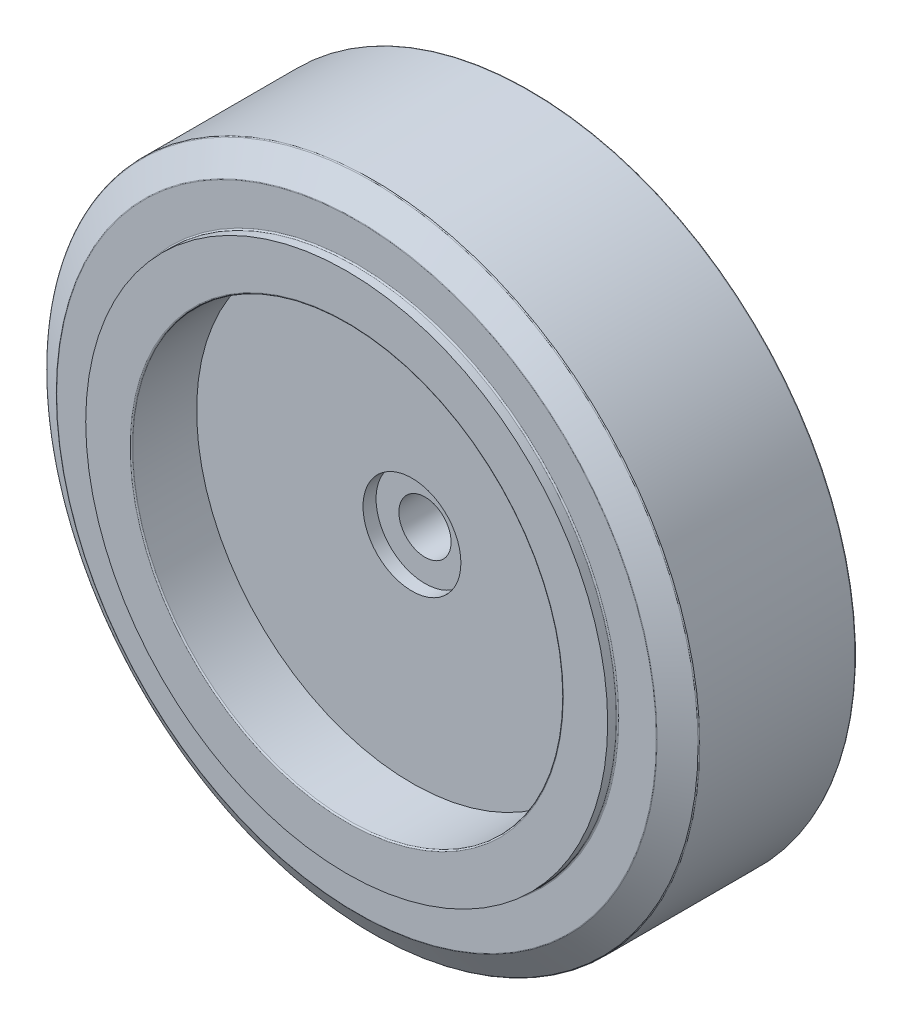
ISO-10303-21;
HEADER;
FILE_DESCRIPTION(('STEP AP214'),'2;1');
FILE_NAME('part.step','',(''),(''),'','','');
FILE_SCHEMA(('AUTOMOTIVE_DESIGN { 1 0 10303 214 1 1 1 1 }'));
ENDSEC;
DATA;
#1=APPLICATION_CONTEXT('core data for automotive mechanical design processes');
#2=APPLICATION_PROTOCOL_DEFINITION('international standard','automotive_design',2000,#1);
#3=PRODUCT_CONTEXT('',#1,'mechanical');
#4=PRODUCT('Part','Part','',(#3));
#5=PRODUCT_RELATED_PRODUCT_CATEGORY('part','',(#4));
#6=PRODUCT_DEFINITION_FORMATION('','',#4);
#7=PRODUCT_DEFINITION_CONTEXT('part definition',#1,'design');
#8=PRODUCT_DEFINITION('design','',#6,#7);
#9=PRODUCT_DEFINITION_SHAPE('','',#8);
#10=(LENGTH_UNIT() NAMED_UNIT(*) SI_UNIT(.MILLI.,.METRE.));
#11=(NAMED_UNIT(*) PLANE_ANGLE_UNIT() SI_UNIT($,.RADIAN.));
#12=(NAMED_UNIT(*) SI_UNIT($,.STERADIAN.) SOLID_ANGLE_UNIT());
#13=UNCERTAINTY_MEASURE_WITH_UNIT(LENGTH_MEASURE(1.E-05),#10,'distance_accuracy_value','');
#14=(GEOMETRIC_REPRESENTATION_CONTEXT(3) GLOBAL_UNCERTAINTY_ASSIGNED_CONTEXT((#13)) GLOBAL_UNIT_ASSIGNED_CONTEXT((#10,
#11,#12)) REPRESENTATION_CONTEXT('',''));
#15=CARTESIAN_POINT('',(0.,0.,0.));
#16=DIRECTION('',(0.,0.,1.));
#17=DIRECTION('',(1.,0.,0.));
#18=AXIS2_PLACEMENT_3D('',#15,#16,#17);
#19=CARTESIAN_POINT('',(0.,0.,-11.8891504716986));
#20=DIRECTION('',(0.,0.,-1.));
#21=DIRECTION('',(-1.,0.,0.));
#22=AXIS2_PLACEMENT_3D('',#19,#20,#21);
#23=TOROIDAL_SURFACE('',#22,49.8,0.2);
#24=CARTESIAN_POINT('',(0.,0.,-11.8891504716986));
#25=DIRECTION('',(0.,0.,1.));
#26=DIRECTION('',(-1.,0.,0.));
#27=AXIS2_PLACEMENT_3D('',#24,#25,#26);
#28=CIRCLE('',#27,50.);
#29=CARTESIAN_POINT('',(-50.,0.,-11.8891504716986));
#30=VERTEX_POINT('',#29);
#31=EDGE_CURVE('E39',#30,#30,#28,.T.);
#32=ORIENTED_EDGE('',*,*,#31,.F.);
#33=EDGE_LOOP('',(#32));
#34=FACE_BOUND('',#33,.T.);
#35=CARTESIAN_POINT('',(0.,0.,-12.0587501324996));
#36=DIRECTION('',(0.,0.,-1.));
#37=DIRECTION('',(1.,0.,0.));
#38=AXIS2_PLACEMENT_3D('',#35,#36,#37);
#39=CIRCLE('',#38,49.9059997880006);
#40=CARTESIAN_POINT('',(-49.9059997880006,0.,-12.0587501324996));
#41=VERTEX_POINT('',#40);
#42=EDGE_CURVE('E20',#41,#41,#39,.T.);
#43=ORIENTED_EDGE('',*,*,#42,.F.);
#44=EDGE_LOOP('',(#43));
#45=FACE_BOUND('',#44,.T.);
#46=ADVANCED_FACE('F16',(#34,#45),#23,.T.);
#47=CARTESIAN_POINT('',(0.,0.,14.3));
#48=DIRECTION('',(0.,0.,1.));
#49=DIRECTION('',(1.,0.,0.));
#50=AXIS2_PLACEMENT_3D('',#47,#48,#49);
#51=TOROIDAL_SURFACE('',#50,45.9426407547177,0.2);
#52=CARTESIAN_POINT('',(0.,0.,14.469599660801));
#53=DIRECTION('',(0.,0.,-1.));
#54=DIRECTION('',(1.,0.,0.));
#55=AXIS2_PLACEMENT_3D('',#52,#53,#54);
#56=CIRCLE('',#55,46.0486405427184);
#57=CARTESIAN_POINT('',(46.0486405427184,0.,14.469599660801));
#58=VERTEX_POINT('',#57);
#59=EDGE_CURVE('E134',#58,#58,#56,.T.);
#60=ORIENTED_EDGE('',*,*,#59,.F.);
#61=EDGE_LOOP('',(#60));
#62=FACE_BOUND('',#61,.T.);
#63=CARTESIAN_POINT('',(0.,0.,14.5));
#64=DIRECTION('',(0.,0.,1.));
#65=DIRECTION('',(1.,0.,0.));
#66=AXIS2_PLACEMENT_3D('',#63,#64,#65);
#67=CIRCLE('',#66,45.9426407547177);
#68=CARTESIAN_POINT('',(45.9426407547177,0.,14.5));
#69=VERTEX_POINT('',#68);
#70=EDGE_CURVE('E161',#69,#69,#67,.T.);
#71=ORIENTED_EDGE('',*,*,#70,.F.);
#72=EDGE_LOOP('',(#71));
#73=FACE_BOUND('',#72,.T.);
#74=ADVANCED_FACE('F135',(#62,#73),#51,.T.);
#75=CARTESIAN_POINT('',(0.,0.,14.7));
#76=DIRECTION('',(0.,0.,1.));
#77=DIRECTION('',(1.,0.,0.));
#78=AXIS2_PLACEMENT_3D('',#75,#76,#77);
#79=TOROIDAL_SURFACE('',#78,40.2,0.2);
#80=CARTESIAN_POINT('',(0.,0.,14.7));
#81=DIRECTION('',(0.,0.,1.));
#82=DIRECTION('',(1.,0.,0.));
#83=AXIS2_PLACEMENT_3D('',#80,#81,#82);
#84=CIRCLE('',#83,40.);
#85=CARTESIAN_POINT('',(40.,0.,14.7));
#86=VERTEX_POINT('',#85);
#87=EDGE_CURVE('E168',#86,#86,#84,.T.);
#88=ORIENTED_EDGE('',*,*,#87,.F.);
#89=EDGE_LOOP('',(#88));
#90=FACE_BOUND('',#89,.T.);
#91=CARTESIAN_POINT('',(0.,0.,14.5));
#92=DIRECTION('',(0.,0.,-1.));
#93=DIRECTION('',(1.,0.,0.));
#94=AXIS2_PLACEMENT_3D('',#91,#92,#93);
#95=CIRCLE('',#94,40.2);
#96=CARTESIAN_POINT('',(40.2,0.,14.5));
#97=VERTEX_POINT('',#96);
#98=EDGE_CURVE('E157',#97,#97,#95,.T.);
#99=ORIENTED_EDGE('',*,*,#98,.F.);
#100=EDGE_LOOP('',(#99));
#101=FACE_BOUND('',#100,.T.);
#102=ADVANCED_FACE('F272',(#90,#101),#79,.F.);
#103=CARTESIAN_POINT('',(0.,0.,-14.3));
#104=DIRECTION('',(0.,0.,-1.));
#105=DIRECTION('',(-1.,0.,0.));
#106=AXIS2_PLACEMENT_3D('',#103,#104,#105);
#107=TOROIDAL_SURFACE('',#106,45.9426407547177,0.2);
#108=CARTESIAN_POINT('',(0.,0.,-14.469599660801));
#109=DIRECTION('',(0.,0.,1.));
#110=DIRECTION('',(-1.,0.,0.));
#111=AXIS2_PLACEMENT_3D('',#108,#109,#110);
#112=CIRCLE('',#111,46.0486405427184);
#113=CARTESIAN_POINT('',(-46.0486405427184,0.,-14.469599660801));
#114=VERTEX_POINT('',#113);
#115=EDGE_CURVE('E11',#114,#114,#112,.T.);
#116=ORIENTED_EDGE('',*,*,#115,.F.);
#117=EDGE_LOOP('',(#116));
#118=FACE_BOUND('',#117,.T.);
#119=CARTESIAN_POINT('',(0.,0.,-14.5));
#120=DIRECTION('',(0.,0.,-1.));
#121=DIRECTION('',(-1.,0.,0.));
#122=AXIS2_PLACEMENT_3D('',#119,#120,#121);
#123=CIRCLE('',#122,45.9426407547177);
#124=CARTESIAN_POINT('',(-45.9426407547177,0.,-14.5));
#125=VERTEX_POINT('',#124);
#126=EDGE_CURVE('E69',#125,#125,#123,.T.);
#127=ORIENTED_EDGE('',*,*,#126,.F.);
#128=EDGE_LOOP('',(#127));
#129=FACE_BOUND('',#128,.T.);
#130=ADVANCED_FACE('F507',(#118,#129),#107,.T.);
#131=CARTESIAN_POINT('',(0.,0.,11.8891504716986));
#132=DIRECTION('',(0.,0.,1.));
#133=DIRECTION('',(1.,0.,0.));
#134=AXIS2_PLACEMENT_3D('',#131,#132,#133);
#135=TOROIDAL_SURFACE('',#134,49.8,0.2);
#136=CARTESIAN_POINT('',(0.,0.,11.8891504716986));
#137=DIRECTION('',(0.,0.,-1.));
#138=DIRECTION('',(1.,0.,0.));
#139=AXIS2_PLACEMENT_3D('',#136,#137,#138);
#140=CIRCLE('',#139,50.);
#141=CARTESIAN_POINT('',(50.,0.,11.8891504716986));
#142=VERTEX_POINT('',#141);
#143=EDGE_CURVE('E181',#142,#142,#140,.T.);
#144=ORIENTED_EDGE('',*,*,#143,.F.);
#145=EDGE_LOOP('',(#144));
#146=FACE_BOUND('',#145,.T.);
#147=CARTESIAN_POINT('',(0.,0.,12.0587501324996));
#148=DIRECTION('',(0.,0.,1.));
#149=DIRECTION('',(-1.,0.,0.));
#150=AXIS2_PLACEMENT_3D('',#147,#148,#149);
#151=CIRCLE('',#150,49.9059997880006);
#152=CARTESIAN_POINT('',(49.9059997880006,0.,12.0587501324996));
#153=VERTEX_POINT('',#152);
#154=EDGE_CURVE('E139',#153,#153,#151,.T.);
#155=ORIENTED_EDGE('',*,*,#154,.F.);
#156=EDGE_LOOP('',(#155));
#157=FACE_BOUND('',#156,.T.);
#158=ADVANCED_FACE('F468',(#146,#157),#135,.T.);
#159=CARTESIAN_POINT('',(0.,0.,-14.7));
#160=DIRECTION('',(0.,0.,-1.));
#161=DIRECTION('',(-1.,0.,0.));
#162=AXIS2_PLACEMENT_3D('',#159,#160,#161);
#163=TOROIDAL_SURFACE('',#162,40.2,0.2);
#164=CARTESIAN_POINT('',(0.,0.,-14.7));
#165=DIRECTION('',(0.,0.,-1.));
#166=DIRECTION('',(-1.,0.,0.));
#167=AXIS2_PLACEMENT_3D('',#164,#165,#166);
#168=CIRCLE('',#167,40.);
#169=CARTESIAN_POINT('',(-40.,0.,-14.7));
#170=VERTEX_POINT('',#169);
#171=EDGE_CURVE('E186',#170,#170,#168,.T.);
#172=ORIENTED_EDGE('',*,*,#171,.F.);
#173=EDGE_LOOP('',(#172));
#174=FACE_BOUND('',#173,.T.);
#175=CARTESIAN_POINT('',(0.,0.,-14.5));
#176=DIRECTION('',(0.,0.,1.));
#177=DIRECTION('',(-1.,0.,0.));
#178=AXIS2_PLACEMENT_3D('',#175,#176,#177);
#179=CIRCLE('',#178,40.2);
#180=CARTESIAN_POINT('',(-40.2,0.,-14.5));
#181=VERTEX_POINT('',#180);
#182=EDGE_CURVE('E220',#181,#181,#179,.T.);
#183=ORIENTED_EDGE('',*,*,#182,.F.);
#184=EDGE_LOOP('',(#183));
#185=FACE_BOUND('',#184,.T.);
#186=ADVANCED_FACE('F262',(#174,#185),#163,.F.);
#187=CARTESIAN_POINT('',(0.,0.,-15.8));
#188=DIRECTION('',(0.,0.,1.));
#189=DIRECTION('',(1.,0.,0.));
#190=AXIS2_PLACEMENT_3D('',#187,#188,#189);
#191=TOROIDAL_SURFACE('',#190,33.2,0.2);
#192=CARTESIAN_POINT('',(0.,0.,-15.8));
#193=DIRECTION('',(0.,0.,-1.));
#194=DIRECTION('',(1.,0.,0.));
#195=AXIS2_PLACEMENT_3D('',#192,#193,#194);
#196=CIRCLE('',#195,33.);
#197=CARTESIAN_POINT('',(33.,0.,-15.8));
#198=VERTEX_POINT('',#197);
#199=EDGE_CURVE('E190',#198,#198,#196,.T.);
#200=ORIENTED_EDGE('',*,*,#199,.F.);
#201=EDGE_LOOP('',(#200));
#202=FACE_BOUND('',#201,.T.);
#203=CARTESIAN_POINT('',(0.,0.,-16.));
#204=DIRECTION('',(0.,0.,1.));
#205=DIRECTION('',(1.,0.,0.));
#206=AXIS2_PLACEMENT_3D('',#203,#204,#205);
#207=CIRCLE('',#206,33.2);
#208=CARTESIAN_POINT('',(33.2,0.,-16.));
#209=VERTEX_POINT('',#208);
#210=EDGE_CURVE('E153',#209,#209,#207,.T.);
#211=ORIENTED_EDGE('',*,*,#210,.F.);
#212=EDGE_LOOP('',(#211));
#213=FACE_BOUND('',#212,.T.);
#214=ADVANCED_FACE('F251',(#202,#213),#191,.T.);
#215=CARTESIAN_POINT('',(0.,0.,15.8));
#216=DIRECTION('',(0.,0.,1.));
#217=DIRECTION('',(1.,0.,0.));
#218=AXIS2_PLACEMENT_3D('',#215,#216,#217);
#219=TOROIDAL_SURFACE('',#218,33.2,0.2);
#220=CARTESIAN_POINT('',(0.,0.,16.));
#221=DIRECTION('',(0.,0.,-1.));
#222=DIRECTION('',(1.,0.,0.));
#223=AXIS2_PLACEMENT_3D('',#220,#221,#222);
#224=CIRCLE('',#223,33.2);
#225=CARTESIAN_POINT('',(33.2,0.,16.));
#226=VERTEX_POINT('',#225);
#227=EDGE_CURVE('E173',#226,#226,#224,.T.);
#228=ORIENTED_EDGE('',*,*,#227,.F.);
#229=EDGE_LOOP('',(#228));
#230=FACE_BOUND('',#229,.T.);
#231=CARTESIAN_POINT('',(0.,0.,15.8));
#232=DIRECTION('',(0.,0.,1.));
#233=DIRECTION('',(1.,0.,0.));
#234=AXIS2_PLACEMENT_3D('',#231,#232,#233);
#235=CIRCLE('',#234,33.);
#236=CARTESIAN_POINT('',(33.,0.,15.8));
#237=VERTEX_POINT('',#236);
#238=EDGE_CURVE('E194',#237,#237,#235,.T.);
#239=ORIENTED_EDGE('',*,*,#238,.F.);
#240=EDGE_LOOP('',(#239));
#241=FACE_BOUND('',#240,.T.);
#242=ADVANCED_FACE('F248',(#230,#241),#219,.T.);
#243=CARTESIAN_POINT('',(0.,0.,-14.5));
#244=DIRECTION('',(0.,0.,1.));
#245=DIRECTION('',(1.,0.,0.));
#246=AXIS2_PLACEMENT_3D('',#243,#244,#245);
#247=CONICAL_SURFACE('',#246,46.,1.01219701145134);
#248=ORIENTED_EDGE('',*,*,#115,.T.);
#249=EDGE_LOOP('',(#248));
#250=FACE_BOUND('',#249,.T.);
#251=ORIENTED_EDGE('',*,*,#42,.T.);
#252=EDGE_LOOP('',(#251));
#253=FACE_BOUND('',#252,.T.);
#254=ADVANCED_FACE('F250',(#250,#253),#247,.T.);
#255=CARTESIAN_POINT('',(0.,0.,14.5));
#256=DIRECTION('',(0.,0.,-1.));
#257=DIRECTION('',(-1.,0.,0.));
#258=AXIS2_PLACEMENT_3D('',#255,#256,#257);
#259=CONICAL_SURFACE('',#258,46.,1.01219701145134);
#260=ORIENTED_EDGE('',*,*,#59,.T.);
#261=EDGE_LOOP('',(#260));
#262=FACE_BOUND('',#261,.T.);
#263=ORIENTED_EDGE('',*,*,#154,.T.);
#264=EDGE_LOOP('',(#263));
#265=FACE_BOUND('',#264,.T.);
#266=ADVANCED_FACE('F259',(#262,#265),#259,.T.);
#267=CARTESIAN_POINT('',(0.,0.,-16.));
#268=DIRECTION('',(0.,0.,1.));
#269=DIRECTION('',(1.,0.,0.));
#270=AXIS2_PLACEMENT_3D('',#267,#268,#269);
#271=CYLINDRICAL_SURFACE('',#270,4.);
#272=CARTESIAN_POINT('',(0.,0.,-4.));
#273=DIRECTION('',(0.,0.,-1.));
#274=DIRECTION('',(-1.,0.,0.));
#275=AXIS2_PLACEMENT_3D('',#272,#273,#274);
#276=CIRCLE('',#275,4.);
#277=CARTESIAN_POINT('',(-4.,0.,-4.));
#278=VERTEX_POINT('',#277);
#279=EDGE_CURVE('E149',#278,#278,#276,.T.);
#280=ORIENTED_EDGE('',*,*,#279,.T.);
#281=EDGE_LOOP('',(#280));
#282=FACE_BOUND('',#281,.T.);
#283=CARTESIAN_POINT('',(0.,0.,4.));
#284=DIRECTION('',(0.,0.,1.));
#285=DIRECTION('',(1.,0.,0.));
#286=AXIS2_PLACEMENT_3D('',#283,#284,#285);
#287=CIRCLE('',#286,4.);
#288=CARTESIAN_POINT('',(4.,0.,4.));
#289=VERTEX_POINT('',#288);
#290=EDGE_CURVE('E156',#289,#289,#287,.T.);
#291=ORIENTED_EDGE('',*,*,#290,.T.);
#292=EDGE_LOOP('',(#291));
#293=FACE_BOUND('',#292,.T.);
#294=ADVANCED_FACE('F288',(#282,#293),#271,.F.);
#295=CARTESIAN_POINT('',(0.,0.,-4.));
#296=DIRECTION('',(0.,0.,-1.));
#297=DIRECTION('',(-1.,0.,0.));
#298=AXIS2_PLACEMENT_3D('',#295,#296,#297);
#299=CYLINDRICAL_SURFACE('',#298,7.5);
#300=CARTESIAN_POINT('',(0.,0.,-4.));
#301=DIRECTION('',(0.,0.,1.));
#302=DIRECTION('',(1.,0.,0.));
#303=AXIS2_PLACEMENT_3D('',#300,#301,#302);
#304=CIRCLE('',#303,7.5);
#305=CARTESIAN_POINT('',(7.5,0.,-4.));
#306=VERTEX_POINT('',#305);
#307=EDGE_CURVE('E172',#306,#306,#304,.T.);
#308=ORIENTED_EDGE('',*,*,#307,.T.);
#309=EDGE_LOOP('',(#308));
#310=FACE_BOUND('',#309,.T.);
#311=CARTESIAN_POINT('',(0.,0.,-6.));
#312=DIRECTION('',(0.,0.,1.));
#313=DIRECTION('',(1.,0.,0.));
#314=AXIS2_PLACEMENT_3D('',#311,#312,#313);
#315=CIRCLE('',#314,7.5);
#316=CARTESIAN_POINT('',(-7.5,0.,-6.));
#317=VERTEX_POINT('',#316);
#318=EDGE_CURVE('E182',#317,#317,#315,.T.);
#319=ORIENTED_EDGE('',*,*,#318,.F.);
#320=EDGE_LOOP('',(#319));
#321=FACE_BOUND('',#320,.T.);
#322=ADVANCED_FACE('F290',(#310,#321),#299,.F.);
#323=CARTESIAN_POINT('',(0.,0.,-6.));
#324=DIRECTION('',(0.,0.,-1.));
#325=DIRECTION('',(-1.,0.,0.));
#326=AXIS2_PLACEMENT_3D('',#323,#324,#325);
#327=CYLINDRICAL_SURFACE('',#326,33.);
#328=CARTESIAN_POINT('',(0.,0.,-6.));
#329=DIRECTION('',(0.,0.,1.));
#330=DIRECTION('',(1.,0.,0.));
#331=AXIS2_PLACEMENT_3D('',#328,#329,#330);
#332=CIRCLE('',#331,33.);
#333=CARTESIAN_POINT('',(33.,0.,-6.));
#334=VERTEX_POINT('',#333);
#335=EDGE_CURVE('E230',#334,#334,#332,.T.);
#336=ORIENTED_EDGE('',*,*,#335,.T.);
#337=EDGE_LOOP('',(#336));
#338=FACE_BOUND('',#337,.T.);
#339=ORIENTED_EDGE('',*,*,#199,.T.);
#340=EDGE_LOOP('',(#339));
#341=FACE_BOUND('',#340,.T.);
#342=ADVANCED_FACE('F524',(#338,#341),#327,.F.);
#343=CARTESIAN_POINT('',(0.,0.,-14.5));
#344=DIRECTION('',(0.,0.,-1.));
#345=DIRECTION('',(-1.,0.,0.));
#346=AXIS2_PLACEMENT_3D('',#343,#344,#345);
#347=CYLINDRICAL_SURFACE('',#346,40.);
#348=ORIENTED_EDGE('',*,*,#171,.T.);
#349=EDGE_LOOP('',(#348));
#350=FACE_BOUND('',#349,.T.);
#351=CARTESIAN_POINT('',(0.,0.,-16.));
#352=DIRECTION('',(0.,0.,1.));
#353=DIRECTION('',(1.,0.,0.));
#354=AXIS2_PLACEMENT_3D('',#351,#352,#353);
#355=CIRCLE('',#354,40.);
#356=CARTESIAN_POINT('',(-40.,0.,-16.));
#357=VERTEX_POINT('',#356);
#358=EDGE_CURVE('E167',#357,#357,#355,.T.);
#359=ORIENTED_EDGE('',*,*,#358,.T.);
#360=EDGE_LOOP('',(#359));
#361=FACE_BOUND('',#360,.T.);
#362=ADVANCED_FACE('F520',(#350,#361),#347,.T.);
#363=CARTESIAN_POINT('',(0.,0.,4.));
#364=DIRECTION('',(0.,0.,1.));
#365=DIRECTION('',(1.,0.,0.));
#366=AXIS2_PLACEMENT_3D('',#363,#364,#365);
#367=CYLINDRICAL_SURFACE('',#366,7.5);
#368=CARTESIAN_POINT('',(0.,0.,4.));
#369=DIRECTION('',(0.,0.,1.));
#370=DIRECTION('',(1.,0.,0.));
#371=AXIS2_PLACEMENT_3D('',#368,#369,#370);
#372=CIRCLE('',#371,7.5);
#373=CARTESIAN_POINT('',(7.5,0.,4.));
#374=VERTEX_POINT('',#373);
#375=EDGE_CURVE('E162',#374,#374,#372,.T.);
#376=ORIENTED_EDGE('',*,*,#375,.F.);
#377=EDGE_LOOP('',(#376));
#378=FACE_BOUND('',#377,.T.);
#379=CARTESIAN_POINT('',(0.,0.,6.));
#380=DIRECTION('',(0.,0.,1.));
#381=DIRECTION('',(1.,0.,0.));
#382=AXIS2_PLACEMENT_3D('',#379,#380,#381);
#383=CIRCLE('',#382,7.5);
#384=CARTESIAN_POINT('',(7.5,0.,6.));
#385=VERTEX_POINT('',#384);
#386=EDGE_CURVE('E163',#385,#385,#383,.T.);
#387=ORIENTED_EDGE('',*,*,#386,.T.);
#388=EDGE_LOOP('',(#387));
#389=FACE_BOUND('',#388,.T.);
#390=ADVANCED_FACE('F298',(#378,#389),#367,.F.);
#391=CARTESIAN_POINT('',(0.,0.,14.5));
#392=DIRECTION('',(0.,0.,1.));
#393=DIRECTION('',(1.,0.,0.));
#394=AXIS2_PLACEMENT_3D('',#391,#392,#393);
#395=CYLINDRICAL_SURFACE('',#394,40.);
#396=ORIENTED_EDGE('',*,*,#87,.T.);
#397=EDGE_LOOP('',(#396));
#398=FACE_BOUND('',#397,.T.);
#399=CARTESIAN_POINT('',(0.,0.,16.));
#400=DIRECTION('',(0.,0.,1.));
#401=DIRECTION('',(1.,0.,0.));
#402=AXIS2_PLACEMENT_3D('',#399,#400,#401);
#403=CIRCLE('',#402,40.);
#404=CARTESIAN_POINT('',(40.,0.,16.));
#405=VERTEX_POINT('',#404);
#406=EDGE_CURVE('E177',#405,#405,#403,.T.);
#407=ORIENTED_EDGE('',*,*,#406,.F.);
#408=EDGE_LOOP('',(#407));
#409=FACE_BOUND('',#408,.T.);
#410=ADVANCED_FACE('F293',(#398,#409),#395,.T.);
#411=CARTESIAN_POINT('',(0.,0.,6.));
#412=DIRECTION('',(0.,0.,1.));
#413=DIRECTION('',(1.,0.,0.));
#414=AXIS2_PLACEMENT_3D('',#411,#412,#413);
#415=CYLINDRICAL_SURFACE('',#414,33.);
#416=CARTESIAN_POINT('',(0.,0.,6.));
#417=DIRECTION('',(0.,0.,1.));
#418=DIRECTION('',(1.,0.,0.));
#419=AXIS2_PLACEMENT_3D('',#416,#417,#418);
#420=CIRCLE('',#419,33.);
#421=CARTESIAN_POINT('',(33.,0.,6.));
#422=VERTEX_POINT('',#421);
#423=EDGE_CURVE('E178',#422,#422,#420,.T.);
#424=ORIENTED_EDGE('',*,*,#423,.F.);
#425=EDGE_LOOP('',(#424));
#426=FACE_BOUND('',#425,.T.);
#427=ORIENTED_EDGE('',*,*,#238,.T.);
#428=EDGE_LOOP('',(#427));
#429=FACE_BOUND('',#428,.T.);
#430=ADVANCED_FACE('F246',(#426,#429),#415,.F.);
#431=CARTESIAN_POINT('',(0.,0.,16.));
#432=DIRECTION('',(0.,0.,-1.));
#433=DIRECTION('',(-1.,0.,0.));
#434=AXIS2_PLACEMENT_3D('',#431,#432,#433);
#435=CYLINDRICAL_SURFACE('',#434,50.);
#436=ORIENTED_EDGE('',*,*,#143,.T.);
#437=EDGE_LOOP('',(#436));
#438=FACE_BOUND('',#437,.T.);
#439=ORIENTED_EDGE('',*,*,#31,.T.);
#440=EDGE_LOOP('',(#439));
#441=FACE_BOUND('',#440,.T.);
#442=ADVANCED_FACE('F283',(#438,#441),#435,.T.);
#443=CARTESIAN_POINT('',(0.,0.,-6.));
#444=DIRECTION('',(0.,0.,-1.));
#445=DIRECTION('',(0.,-1.,0.));
#446=AXIS2_PLACEMENT_3D('',#443,#444,#445);
#447=PLANE('',#446);
#448=ORIENTED_EDGE('',*,*,#335,.F.);
#449=EDGE_LOOP('',(#448));
#450=FACE_BOUND('',#449,.T.);
#451=ORIENTED_EDGE('',*,*,#318,.T.);
#452=EDGE_LOOP('',(#451));
#453=FACE_BOUND('',#452,.T.);
#454=ADVANCED_FACE('F285',(#450,#453),#447,.T.);
#455=CARTESIAN_POINT('',(0.,0.,16.));
#456=DIRECTION('',(0.,0.,1.));
#457=DIRECTION('',(1.,0.,0.));
#458=AXIS2_PLACEMENT_3D('',#455,#456,#457);
#459=PLANE('',#458);
#460=ORIENTED_EDGE('',*,*,#406,.T.);
#461=EDGE_LOOP('',(#460));
#462=FACE_BOUND('',#461,.T.);
#463=ORIENTED_EDGE('',*,*,#227,.T.);
#464=EDGE_LOOP('',(#463));
#465=FACE_BOUND('',#464,.T.);
#466=ADVANCED_FACE('F277',(#462,#465),#459,.T.);
#467=CARTESIAN_POINT('',(0.,0.,6.));
#468=DIRECTION('',(0.,0.,1.));
#469=DIRECTION('',(1.,0.,0.));
#470=AXIS2_PLACEMENT_3D('',#467,#468,#469);
#471=PLANE('',#470);
#472=ORIENTED_EDGE('',*,*,#423,.T.);
#473=EDGE_LOOP('',(#472));
#474=FACE_BOUND('',#473,.T.);
#475=ORIENTED_EDGE('',*,*,#386,.F.);
#476=EDGE_LOOP('',(#475));
#477=FACE_BOUND('',#476,.T.);
#478=ADVANCED_FACE('F460',(#474,#477),#471,.T.);
#479=CARTESIAN_POINT('',(0.,0.,14.5));
#480=DIRECTION('',(0.,0.,1.));
#481=DIRECTION('',(1.,0.,0.));
#482=AXIS2_PLACEMENT_3D('',#479,#480,#481);
#483=PLANE('',#482);
#484=ORIENTED_EDGE('',*,*,#70,.T.);
#485=EDGE_LOOP('',(#484));
#486=FACE_BOUND('',#485,.T.);
#487=ORIENTED_EDGE('',*,*,#98,.T.);
#488=EDGE_LOOP('',(#487));
#489=FACE_BOUND('',#488,.T.);
#490=ADVANCED_FACE('F282',(#486,#489),#483,.T.);
#491=CARTESIAN_POINT('',(0.,0.,4.));
#492=DIRECTION('',(0.,0.,1.));
#493=DIRECTION('',(1.,0.,0.));
#494=AXIS2_PLACEMENT_3D('',#491,#492,#493);
#495=PLANE('',#494);
#496=ORIENTED_EDGE('',*,*,#375,.T.);
#497=EDGE_LOOP('',(#496));
#498=FACE_BOUND('',#497,.T.);
#499=ORIENTED_EDGE('',*,*,#290,.F.);
#500=EDGE_LOOP('',(#499));
#501=FACE_BOUND('',#500,.T.);
#502=ADVANCED_FACE('F278',(#498,#501),#495,.T.);
#503=CARTESIAN_POINT('',(0.,0.,-14.5));
#504=DIRECTION('',(0.,0.,-1.));
#505=DIRECTION('',(0.,-1.,0.));
#506=AXIS2_PLACEMENT_3D('',#503,#504,#505);
#507=PLANE('',#506);
#508=ORIENTED_EDGE('',*,*,#126,.T.);
#509=EDGE_LOOP('',(#508));
#510=FACE_BOUND('',#509,.T.);
#511=ORIENTED_EDGE('',*,*,#182,.T.);
#512=EDGE_LOOP('',(#511));
#513=FACE_BOUND('',#512,.T.);
#514=ADVANCED_FACE('F281',(#510,#513),#507,.T.);
#515=CARTESIAN_POINT('',(0.,0.,-16.));
#516=DIRECTION('',(0.,0.,1.));
#517=DIRECTION('',(1.,0.,0.));
#518=AXIS2_PLACEMENT_3D('',#515,#516,#517);
#519=PLANE('',#518);
#520=ORIENTED_EDGE('',*,*,#358,.F.);
#521=EDGE_LOOP('',(#520));
#522=FACE_BOUND('',#521,.T.);
#523=ORIENTED_EDGE('',*,*,#210,.T.);
#524=EDGE_LOOP('',(#523));
#525=FACE_BOUND('',#524,.T.);
#526=ADVANCED_FACE('F422',(#522,#525),#519,.F.);
#527=CARTESIAN_POINT('',(0.,0.,-4.));
#528=DIRECTION('',(0.,0.,-1.));
#529=DIRECTION('',(0.,-1.,0.));
#530=AXIS2_PLACEMENT_3D('',#527,#528,#529);
#531=PLANE('',#530);
#532=ORIENTED_EDGE('',*,*,#307,.F.);
#533=EDGE_LOOP('',(#532));
#534=FACE_BOUND('',#533,.T.);
#535=ORIENTED_EDGE('',*,*,#279,.F.);
#536=EDGE_LOOP('',(#535));
#537=FACE_BOUND('',#536,.T.);
#538=ADVANCED_FACE('F18',(#534,#537),#531,.T.);
#539=CLOSED_SHELL('',(#46,#74,#102,#130,#158,#186,#214,#242,#254,#266,#294,#322,#342,#362,#390,
#410,#430,#442,#454,#466,#478,#490,#502,#514,#526,#538));
#540=MANIFOLD_SOLID_BREP('B1',#539);
#541=ADVANCED_BREP_SHAPE_REPRESENTATION('',(#18,#540),#14);
#542=SHAPE_DEFINITION_REPRESENTATION(#9,#541);
ENDSEC;
END-ISO-10303-21;
